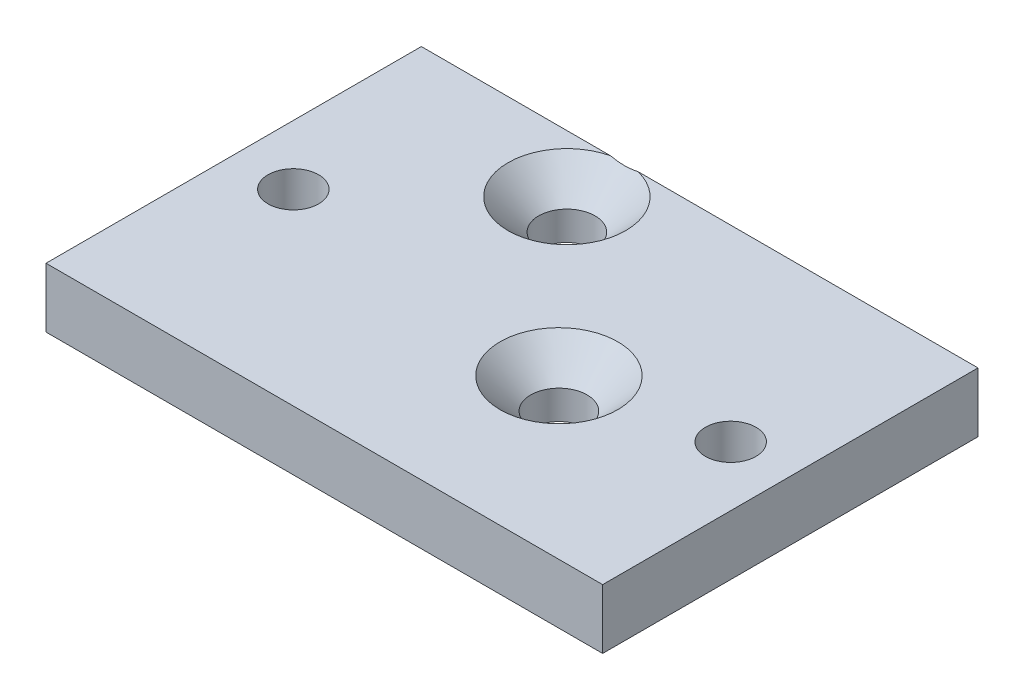
ISO-10303-21;
HEADER;
FILE_DESCRIPTION(('STEP AP214'),'2;1');
FILE_NAME('part.step','',(''),(''),'','','');
FILE_SCHEMA(('AUTOMOTIVE_DESIGN { 1 0 10303 214 1 1 1 1 }'));
ENDSEC;
DATA;
#1=APPLICATION_CONTEXT('core data for automotive mechanical design processes');
#2=APPLICATION_PROTOCOL_DEFINITION('international standard','automotive_design',2000,#1);
#3=PRODUCT_CONTEXT('',#1,'mechanical');
#4=PRODUCT('Part','Part','',(#3));
#5=PRODUCT_RELATED_PRODUCT_CATEGORY('part','',(#4));
#6=PRODUCT_DEFINITION_FORMATION('','',#4);
#7=PRODUCT_DEFINITION_CONTEXT('part definition',#1,'design');
#8=PRODUCT_DEFINITION('design','',#6,#7);
#9=PRODUCT_DEFINITION_SHAPE('','',#8);
#10=(LENGTH_UNIT() NAMED_UNIT(*) SI_UNIT(.MILLI.,.METRE.));
#11=(NAMED_UNIT(*) PLANE_ANGLE_UNIT() SI_UNIT($,.RADIAN.));
#12=(NAMED_UNIT(*) SI_UNIT($,.STERADIAN.) SOLID_ANGLE_UNIT());
#13=UNCERTAINTY_MEASURE_WITH_UNIT(LENGTH_MEASURE(1.E-05),#10,'distance_accuracy_value','');
#14=(GEOMETRIC_REPRESENTATION_CONTEXT(3) GLOBAL_UNCERTAINTY_ASSIGNED_CONTEXT((#13)) GLOBAL_UNIT_ASSIGNED_CONTEXT((#10,
#11,#12)) REPRESENTATION_CONTEXT('',''));
#15=CARTESIAN_POINT('',(0.,0.,0.));
#16=DIRECTION('',(0.,0.,1.));
#17=DIRECTION('',(1.,0.,0.));
#18=AXIS2_PLACEMENT_3D('',#15,#16,#17);
#19=CARTESIAN_POINT('',(0.,0.,-29.972));
#20=DIRECTION('',(0.,-1.,0.));
#21=DIRECTION('',(0.,0.,-1.));
#22=AXIS2_PLACEMENT_3D('',#19,#20,#21);
#23=PLANE('',#22);
#24=CARTESIAN_POINT('',(16.1925,0.,-25.4));
#25=DIRECTION('',(0.,1.,0.));
#26=DIRECTION('',(0.,0.,1.));
#27=AXIS2_PLACEMENT_3D('',#24,#25,#26);
#28=CIRCLE('',#27,2.25);
#29=CARTESIAN_POINT('',(16.1925,0.,-23.15));
#30=VERTEX_POINT('',#29);
#31=EDGE_CURVE('E158',#30,#30,#28,.T.);
#32=ORIENTED_EDGE('',*,*,#31,.T.);
#33=EDGE_LOOP('',(#32));
#34=FACE_BOUND('',#33,.T.);
#35=CARTESIAN_POINT('',(39.6875,0.,-14.986));
#36=DIRECTION('',(0.,1.,0.));
#37=DIRECTION('',(0.,0.,1.));
#38=AXIS2_PLACEMENT_3D('',#35,#36,#37);
#39=CIRCLE('',#38,2.01929999999999);
#40=CARTESIAN_POINT('',(39.6875,0.,-12.9667));
#41=VERTEX_POINT('',#40);
#42=EDGE_CURVE('E126',#41,#41,#39,.T.);
#43=ORIENTED_EDGE('',*,*,#42,.T.);
#44=EDGE_LOOP('',(#43));
#45=FACE_BOUND('',#44,.T.);
#46=DIRECTION('',(0.,0.,1.));
#47=VECTOR('',#46,1.);
#48=CARTESIAN_POINT('',(0.,0.,0.));
#49=LINE('',#48,#47);
#50=CARTESIAN_POINT('',(0.,0.,-29.972));
#51=VERTEX_POINT('',#50);
#52=CARTESIAN_POINT('',(0.,0.,0.));
#53=VERTEX_POINT('',#52);
#54=EDGE_CURVE('E118',#51,#53,#49,.T.);
#55=ORIENTED_EDGE('',*,*,#54,.F.);
#56=DIRECTION('',(-1.,0.,0.));
#57=VECTOR('',#56,1.);
#58=CARTESIAN_POINT('',(0.,0.,-29.972));
#59=LINE('',#58,#57);
#60=CARTESIAN_POINT('',(44.45,0.,-29.972));
#61=VERTEX_POINT('',#60);
#62=EDGE_CURVE('E131',#61,#51,#59,.T.);
#63=ORIENTED_EDGE('',*,*,#62,.F.);
#64=DIRECTION('',(0.,0.,-1.));
#65=VECTOR('',#64,1.);
#66=CARTESIAN_POINT('',(44.45,0.,0.));
#67=LINE('',#66,#65);
#68=CARTESIAN_POINT('',(44.45,0.,0.));
#69=VERTEX_POINT('',#68);
#70=EDGE_CURVE('E123',#69,#61,#67,.T.);
#71=ORIENTED_EDGE('',*,*,#70,.F.);
#72=DIRECTION('',(1.,0.,0.));
#73=VECTOR('',#72,1.);
#74=CARTESIAN_POINT('',(0.,0.,0.));
#75=LINE('',#74,#73);
#76=EDGE_CURVE('E115',#53,#69,#75,.T.);
#77=ORIENTED_EDGE('',*,*,#76,.F.);
#78=EDGE_LOOP('',(#55,#63,#71,#77));
#79=FACE_BOUND('',#78,.T.);
#80=CARTESIAN_POINT('',(4.7625,0.,-14.986));
#81=DIRECTION('',(0.,1.,0.));
#82=DIRECTION('',(0.,0.,1.));
#83=AXIS2_PLACEMENT_3D('',#80,#81,#82);
#84=CIRCLE('',#83,2.01929999999999);
#85=CARTESIAN_POINT('',(4.7625,0.,-12.9667));
#86=VERTEX_POINT('',#85);
#87=EDGE_CURVE('E90',#86,#86,#84,.T.);
#88=ORIENTED_EDGE('',*,*,#87,.T.);
#89=EDGE_LOOP('',(#88));
#90=FACE_BOUND('',#89,.T.);
#91=CARTESIAN_POINT('',(28.2575,0.,-12.7));
#92=DIRECTION('',(0.,1.,0.));
#93=DIRECTION('',(0.,0.,1.));
#94=AXIS2_PLACEMENT_3D('',#91,#92,#93);
#95=CIRCLE('',#94,2.25);
#96=CARTESIAN_POINT('',(28.2575,0.,-10.45));
#97=VERTEX_POINT('',#96);
#98=EDGE_CURVE('E148',#97,#97,#95,.T.);
#99=ORIENTED_EDGE('',*,*,#98,.T.);
#100=EDGE_LOOP('',(#99));
#101=FACE_BOUND('',#100,.T.);
#102=ADVANCED_FACE('F35',(#34,#45,#79,#90,#101),#23,.T.);
#103=CARTESIAN_POINT('',(0.,4.7625,0.));
#104=DIRECTION('',(1.,0.,0.));
#105=DIRECTION('',(0.,0.,-1.));
#106=AXIS2_PLACEMENT_3D('',#103,#104,#105);
#107=PLANE('',#106);
#108=ORIENTED_EDGE('',*,*,#54,.T.);
#109=DIRECTION('',(0.,-1.,0.));
#110=VECTOR('',#109,1.);
#111=CARTESIAN_POINT('',(0.,4.7625,0.));
#112=LINE('',#111,#110);
#113=CARTESIAN_POINT('',(0.,4.7625,0.));
#114=VERTEX_POINT('',#113);
#115=EDGE_CURVE('E48',#114,#53,#112,.T.);
#116=ORIENTED_EDGE('',*,*,#115,.F.);
#117=DIRECTION('',(0.,0.,1.));
#118=VECTOR('',#117,1.);
#119=CARTESIAN_POINT('',(0.,4.7625,0.));
#120=LINE('',#119,#118);
#121=CARTESIAN_POINT('',(0.,4.7625,-29.972));
#122=VERTEX_POINT('',#121);
#123=EDGE_CURVE('E133',#122,#114,#120,.T.);
#124=ORIENTED_EDGE('',*,*,#123,.F.);
#125=DIRECTION('',(0.,-1.,0.));
#126=VECTOR('',#125,1.);
#127=CARTESIAN_POINT('',(0.,4.7625,-29.972));
#128=LINE('',#127,#126);
#129=EDGE_CURVE('E95',#122,#51,#128,.T.);
#130=ORIENTED_EDGE('',*,*,#129,.T.);
#131=EDGE_LOOP('',(#108,#116,#124,#130));
#132=FACE_BOUND('',#131,.T.);
#133=ADVANCED_FACE('F37',(#132),#107,.F.);
#134=CARTESIAN_POINT('',(0.,4.7625,0.));
#135=DIRECTION('',(0.,0.,-1.));
#136=DIRECTION('',(-1.,0.,0.));
#137=AXIS2_PLACEMENT_3D('',#134,#135,#136);
#138=PLANE('',#137);
#139=ORIENTED_EDGE('',*,*,#76,.T.);
#140=DIRECTION('',(0.,-1.,0.));
#141=VECTOR('',#140,1.);
#142=CARTESIAN_POINT('',(44.45,4.7625,0.));
#143=LINE('',#142,#141);
#144=CARTESIAN_POINT('',(44.45,4.7625,0.));
#145=VERTEX_POINT('',#144);
#146=EDGE_CURVE('E107',#145,#69,#143,.T.);
#147=ORIENTED_EDGE('',*,*,#146,.F.);
#148=DIRECTION('',(1.,0.,0.));
#149=VECTOR('',#148,1.);
#150=CARTESIAN_POINT('',(0.,4.7625,0.));
#151=LINE('',#150,#149);
#152=EDGE_CURVE('E99',#114,#145,#151,.T.);
#153=ORIENTED_EDGE('',*,*,#152,.F.);
#154=ORIENTED_EDGE('',*,*,#115,.T.);
#155=EDGE_LOOP('',(#139,#147,#153,#154));
#156=FACE_BOUND('',#155,.T.);
#157=ADVANCED_FACE('F113',(#156),#138,.F.);
#158=CARTESIAN_POINT('',(44.45,4.7625,0.));
#159=DIRECTION('',(-1.,0.,0.));
#160=DIRECTION('',(0.,0.,1.));
#161=AXIS2_PLACEMENT_3D('',#158,#159,#160);
#162=PLANE('',#161);
#163=ORIENTED_EDGE('',*,*,#70,.T.);
#164=DIRECTION('',(0.,-1.,0.));
#165=VECTOR('',#164,1.);
#166=CARTESIAN_POINT('',(44.45,4.7625,-29.972));
#167=LINE('',#166,#165);
#168=CARTESIAN_POINT('',(44.45,4.7625,-29.972));
#169=VERTEX_POINT('',#168);
#170=EDGE_CURVE('E104',#169,#61,#167,.T.);
#171=ORIENTED_EDGE('',*,*,#170,.F.);
#172=DIRECTION('',(0.,0.,-1.));
#173=VECTOR('',#172,1.);
#174=CARTESIAN_POINT('',(44.45,4.7625,0.));
#175=LINE('',#174,#173);
#176=EDGE_CURVE('E97',#145,#169,#175,.T.);
#177=ORIENTED_EDGE('',*,*,#176,.F.);
#178=ORIENTED_EDGE('',*,*,#146,.T.);
#179=EDGE_LOOP('',(#163,#171,#177,#178));
#180=FACE_BOUND('',#179,.T.);
#181=ADVANCED_FACE('F138',(#180),#162,.F.);
#182=CARTESIAN_POINT('',(0.,4.7625,-29.972));
#183=DIRECTION('',(0.,0.,1.));
#184=DIRECTION('',(1.,0.,0.));
#185=AXIS2_PLACEMENT_3D('',#182,#183,#184);
#186=PLANE('',#185);
#187=DIRECTION('',(-1.,0.,0.));
#188=VECTOR('',#187,1.);
#189=CARTESIAN_POINT('',(0.,4.7625,-29.972));
#190=LINE('',#189,#188);
#191=CARTESIAN_POINT('',(15.1030891500449,4.7625,-29.972));
#192=VERTEX_POINT('',#191);
#193=EDGE_CURVE('E60',#192,#122,#190,.T.);
#194=ORIENTED_EDGE('',*,*,#193,.F.);
#195=CARTESIAN_POINT('',(6.24009764916176,11.0148283621781,-29.972));
#196=CARTESIAN_POINT('',(6.45195342883205,10.8223349293208,-29.972));
#197=CARTESIAN_POINT('',(6.66432476272242,10.6304051010854,-29.972));
#198=CARTESIAN_POINT('',(7.09034867112008,10.2479513489384,-29.972));
#199=CARTESIAN_POINT('',(7.30400131061275,10.0574274974473,-29.972));
#200=CARTESIAN_POINT('',(7.7333116237082,9.67764600004868,-29.972));
#201=CARTESIAN_POINT('',(7.94897278889506,9.48839229578767,-29.972));
#202=CARTESIAN_POINT('',(8.38213151876999,9.11200493672459,-29.972));
#203=CARTESIAN_POINT('',(8.59962904483972,8.92487123753207,-29.972));
#204=CARTESIAN_POINT('',(9.05686416110622,8.53626251613531,-29.972));
#205=CARTESIAN_POINT('',(9.29681717417677,8.33504040514064,-29.972));
#206=CARTESIAN_POINT('',(9.78011213959654,7.93670791722538,-29.972));
#207=CARTESIAN_POINT('',(10.0234539947177,7.73959742274349,-29.972));
#208=CARTESIAN_POINT('',(10.5142412619671,7.35107548865928,-29.972));
#209=CARTESIAN_POINT('',(10.7616820755168,7.15965825768191,-29.972));
#210=CARTESIAN_POINT('',(11.2622107361905,6.78436045441689,-29.972));
#211=CARTESIAN_POINT('',(11.5152977017044,6.60047871805602,-29.972));
#212=CARTESIAN_POINT('',(11.9038931316203,6.33038890935885,-29.972));
#213=CARTESIAN_POINT('',(12.0366470077691,6.24021908559975,-29.972));
#214=CARTESIAN_POINT('',(12.3044361324151,6.06334135684351,-29.972));
#215=CARTESIAN_POINT('',(12.4394712098689,5.97663319391794,-29.972));
#216=CARTESIAN_POINT('',(12.712380272297,5.80731930880105,-29.972));
#217=CARTESIAN_POINT('',(12.8502582062947,5.72471992549132,-29.972));
#218=CARTESIAN_POINT('',(13.1290364715524,5.56476827028971,-29.972));
#219=CARTESIAN_POINT('',(13.269936706849,5.48741583212182,-29.972));
#220=CARTESIAN_POINT('',(13.5518505596636,5.34095111119898,-29.972));
#221=CARTESIAN_POINT('',(13.6927861206215,5.27168957982904,-29.972));
#222=CARTESIAN_POINT('',(13.978255259558,5.14088262493837,-29.972));
#223=CARTESIAN_POINT('',(14.1227894342639,5.07933849147924,-29.972));
#224=CARTESIAN_POINT('',(14.4151760172279,4.96596445900419,-29.972));
#225=CARTESIAN_POINT('',(14.5630176184399,4.91410697692276,-29.972));
#226=CARTESIAN_POINT('',(14.8622232934016,4.82197567818963,-29.972));
#227=CARTESIAN_POINT('',(15.0135848952628,4.78169398313297,-29.972));
#228=CARTESIAN_POINT('',(15.2797964825983,4.72339796543963,-29.972));
#229=CARTESIAN_POINT('',(15.3939763706465,4.70231944774768,-29.972));
#230=CARTESIAN_POINT('',(15.6235734262336,4.66836365621391,-29.972));
#231=CARTESIAN_POINT('',(15.7389906642036,4.6554868517686,-29.972));
#232=CARTESIAN_POINT('',(15.9703250446608,4.63844357829596,-29.972));
#233=CARTESIAN_POINT('',(16.0862413601427,4.6342660026603,-29.972));
#234=CARTESIAN_POINT('',(16.318055614227,4.63475435892129,-29.972));
#235=CARTESIAN_POINT('',(16.433953552245,4.63942053092871,-29.972));
#236=CARTESIAN_POINT('',(16.6814648984674,4.65869140827196,-29.972));
#237=CARTESIAN_POINT('',(16.8129764704024,4.67461152471454,-29.972));
#238=CARTESIAN_POINT('',(17.0743013062877,4.71697223128381,-29.972));
#239=CARTESIAN_POINT('',(17.2041141064566,4.7434156349352,-29.972));
#240=CARTESIAN_POINT('',(17.4627124349668,4.80599239240662,-29.972));
#241=CARTESIAN_POINT('',(17.5914752355859,4.84221866328578,-29.972));
#242=CARTESIAN_POINT('',(17.8463244827122,4.922922523779,-29.972));
#243=CARTESIAN_POINT('',(17.9724115282192,4.96739824446934,-29.972));
#244=CARTESIAN_POINT('',(18.2709967918466,5.08221674539831,-29.972));
#245=CARTESIAN_POINT('',(18.4422256139544,5.15585000652405,-29.972));
#246=CARTESIAN_POINT('',(18.77977922121,5.3136824504598,-29.972));
#247=CARTESIAN_POINT('',(18.9461011811687,5.39788757899135,-29.972));
#248=CARTESIAN_POINT('',(19.2749314861696,5.57478558471101,-29.972));
#249=CARTESIAN_POINT('',(19.4374233513214,5.66750885800584,-29.972));
#250=CARTESIAN_POINT('',(19.7585313292335,5.85932606697617,-29.972));
#251=CARTESIAN_POINT('',(19.917148204562,5.95841873503703,-29.972));
#252=CARTESIAN_POINT('',(20.2236373018814,6.15678190613575,-29.972));
#253=CARTESIAN_POINT('',(20.3716613828344,6.25581898594016,-29.972));
#254=CARTESIAN_POINT('',(20.6651965702206,6.45756383463478,-29.972));
#255=CARTESIAN_POINT('',(20.8107074692336,6.56027190437554,-29.972));
#256=CARTESIAN_POINT('',(21.0982882989947,6.76772892746014,-29.972));
#257=CARTESIAN_POINT('',(21.2403773548236,6.87245146072977,-29.972));
#258=CARTESIAN_POINT('',(21.522699007952,7.08429481056542,-29.972));
#259=CARTESIAN_POINT('',(21.6629320907778,7.19141497935009,-29.972));
#260=CARTESIAN_POINT('',(21.8024031467771,7.29950195635042,-29.972));
#261=B_SPLINE_CURVE_WITH_KNOTS('',3,(#195,#196,#197,#198,#199,#200,#201,#202,#203,#204,#205,
#206,#207,#208,#209,#210,#211,#212,#213,#214,#215,#216,#217,#218,#219,#220,#221,#222,#223,#224,
#225,#226,#227,#228,#229,#230,#231,#232,#233,#234,#235,#236,#237,#238,#239,#240,#241,#242,#243,
#244,#245,#246,#247,#248,#249,#250,#251,#252,#253,#254,#255,#256,#257,#258,#259,#260),
.UNSPECIFIED.,.F.,.F.,(4,2,2,2,2,2,2,2,2,2,2,2,2,2,2,2,2,2,2,2,2,2,2,2,2,2,2,2,2,2,2,2,4),(0.,
0.858739853234425,1.71752363479409,2.57829122978584,3.43904076786091,4.37848017101969,
5.31789267635762,6.25631441070415,7.19459062819409,7.67599230188746,8.15735803913182,
8.63944473555942,9.1215161474862,9.59243340709465,10.0634292818921,10.5330628235263,
11.0023759745214,11.3504388606916,11.6985216652403,12.0461597871928,12.3938073477743,
12.7907493519877,13.1877975546955,13.5887582695035,13.98962825684,14.5483057569827,
15.1072988822723,15.6683705337668,16.2293308664218,16.763563930981,17.2978408786638,
17.8273461074526,18.3567099639255),.UNSPECIFIED.);
#262=CARTESIAN_POINT('',(17.2819108499551,4.7625,-29.972));
#263=VERTEX_POINT('',#262);
#264=EDGE_CURVE('E11',#192,#263,#261,.T.);
#265=ORIENTED_EDGE('',*,*,#264,.T.);
#266=EDGE_CURVE('E89',#169,#263,#190,.T.);
#267=ORIENTED_EDGE('',*,*,#266,.F.);
#268=ORIENTED_EDGE('',*,*,#170,.T.);
#269=ORIENTED_EDGE('',*,*,#62,.T.);
#270=ORIENTED_EDGE('',*,*,#129,.F.);
#271=EDGE_LOOP('',(#194,#265,#267,#268,#269,#270));
#272=FACE_BOUND('',#271,.T.);
#273=ADVANCED_FACE('F93',(#272),#186,.F.);
#274=CARTESIAN_POINT('',(0.,4.7625,-29.972));
#275=DIRECTION('',(0.,-1.,0.));
#276=DIRECTION('',(0.,0.,-1.));
#277=AXIS2_PLACEMENT_3D('',#274,#275,#276);
#278=PLANE('',#277);
#279=CARTESIAN_POINT('',(28.2575,4.7625,-12.7));
#280=DIRECTION('',(0.,1.,0.));
#281=DIRECTION('',(0.,0.,1.));
#282=AXIS2_PLACEMENT_3D('',#279,#280,#281);
#283=CIRCLE('',#282,4.7);
#284=CARTESIAN_POINT('',(28.2575,4.7625,-8.));
#285=VERTEX_POINT('',#284);
#286=EDGE_CURVE('E153',#285,#285,#283,.T.);
#287=ORIENTED_EDGE('',*,*,#286,.F.);
#288=EDGE_LOOP('',(#287));
#289=FACE_BOUND('',#288,.T.);
#290=CARTESIAN_POINT('',(4.7625,4.7625,-14.986));
#291=DIRECTION('',(0.,1.,0.));
#292=DIRECTION('',(0.,0.,1.));
#293=AXIS2_PLACEMENT_3D('',#290,#291,#292);
#294=CIRCLE('',#293,2.01929999999999);
#295=CARTESIAN_POINT('',(4.7625,4.7625,-12.9667));
#296=VERTEX_POINT('',#295);
#297=EDGE_CURVE('E164',#296,#296,#294,.T.);
#298=ORIENTED_EDGE('',*,*,#297,.F.);
#299=EDGE_LOOP('',(#298));
#300=FACE_BOUND('',#299,.T.);
#301=CARTESIAN_POINT('',(39.6875,4.7625,-14.986));
#302=DIRECTION('',(0.,1.,0.));
#303=DIRECTION('',(0.,0.,1.));
#304=AXIS2_PLACEMENT_3D('',#301,#302,#303);
#305=CIRCLE('',#304,2.01929999999999);
#306=CARTESIAN_POINT('',(39.6875,4.7625,-12.9667));
#307=VERTEX_POINT('',#306);
#308=EDGE_CURVE('E121',#307,#307,#305,.T.);
#309=ORIENTED_EDGE('',*,*,#308,.F.);
#310=EDGE_LOOP('',(#309));
#311=FACE_BOUND('',#310,.T.);
#312=ORIENTED_EDGE('',*,*,#266,.T.);
#313=CARTESIAN_POINT('',(16.1925,4.7625,-25.4));
#314=DIRECTION('',(0.,1.,0.));
#315=DIRECTION('',(0.,0.,1.));
#316=AXIS2_PLACEMENT_3D('',#313,#314,#315);
#317=CIRCLE('',#316,4.7);
#318=EDGE_CURVE('E54',#192,#263,#317,.T.);
#319=ORIENTED_EDGE('',*,*,#318,.F.);
#320=ORIENTED_EDGE('',*,*,#193,.T.);
#321=ORIENTED_EDGE('',*,*,#123,.T.);
#322=ORIENTED_EDGE('',*,*,#152,.T.);
#323=ORIENTED_EDGE('',*,*,#176,.T.);
#324=EDGE_LOOP('',(#312,#319,#320,#321,#322,#323));
#325=FACE_BOUND('',#324,.T.);
#326=ADVANCED_FACE('F88',(#289,#300,#311,#325),#278,.F.);
#327=CARTESIAN_POINT('',(39.6875,4.7625,-14.986));
#328=DIRECTION('',(0.,1.,0.));
#329=DIRECTION('',(0.,0.,1.));
#330=AXIS2_PLACEMENT_3D('',#327,#328,#329);
#331=CYLINDRICAL_SURFACE('',#330,2.01929999999999);
#332=ORIENTED_EDGE('',*,*,#42,.F.);
#333=EDGE_LOOP('',(#332));
#334=FACE_BOUND('',#333,.T.);
#335=ORIENTED_EDGE('',*,*,#308,.T.);
#336=EDGE_LOOP('',(#335));
#337=FACE_BOUND('',#336,.T.);
#338=ADVANCED_FACE('F170',(#334,#337),#331,.F.);
#339=CARTESIAN_POINT('',(4.7625,4.7625,-14.986));
#340=DIRECTION('',(0.,1.,0.));
#341=DIRECTION('',(0.,0.,1.));
#342=AXIS2_PLACEMENT_3D('',#339,#340,#341);
#343=CYLINDRICAL_SURFACE('',#342,2.01929999999999);
#344=ORIENTED_EDGE('',*,*,#87,.F.);
#345=EDGE_LOOP('',(#344));
#346=FACE_BOUND('',#345,.T.);
#347=ORIENTED_EDGE('',*,*,#297,.T.);
#348=EDGE_LOOP('',(#347));
#349=FACE_BOUND('',#348,.T.);
#350=ADVANCED_FACE('F173',(#346,#349),#343,.F.);
#351=CARTESIAN_POINT('',(16.1925,4.7625,-25.4));
#352=DIRECTION('',(0.,1.,0.));
#353=DIRECTION('',(0.,0.,1.));
#354=AXIS2_PLACEMENT_3D('',#351,#352,#353);
#355=CONICAL_SURFACE('',#354,4.7,0.785398163397449);
#356=CARTESIAN_POINT('',(16.1925,2.3125,-25.4));
#357=DIRECTION('',(0.,1.,0.));
#358=DIRECTION('',(0.,0.,1.));
#359=AXIS2_PLACEMENT_3D('',#356,#357,#358);
#360=CIRCLE('',#359,2.25);
#361=CARTESIAN_POINT('',(16.1925,2.3125,-23.15));
#362=VERTEX_POINT('',#361);
#363=EDGE_CURVE('E91',#362,#362,#360,.T.);
#364=ORIENTED_EDGE('',*,*,#363,.F.);
#365=EDGE_LOOP('',(#364));
#366=FACE_BOUND('',#365,.T.);
#367=ORIENTED_EDGE('',*,*,#318,.T.);
#368=ORIENTED_EDGE('',*,*,#264,.F.);
#369=EDGE_LOOP('',(#367,#368));
#370=FACE_BOUND('',#369,.T.);
#371=ADVANCED_FACE('F84',(#366,#370),#355,.F.);
#372=CARTESIAN_POINT('',(16.1925,4.7625,-25.4));
#373=DIRECTION('',(0.,1.,0.));
#374=DIRECTION('',(0.,0.,1.));
#375=AXIS2_PLACEMENT_3D('',#372,#373,#374);
#376=CYLINDRICAL_SURFACE('',#375,2.25);
#377=ORIENTED_EDGE('',*,*,#31,.F.);
#378=EDGE_LOOP('',(#377));
#379=FACE_BOUND('',#378,.T.);
#380=ORIENTED_EDGE('',*,*,#363,.T.);
#381=EDGE_LOOP('',(#380));
#382=FACE_BOUND('',#381,.T.);
#383=ADVANCED_FACE('F224',(#379,#382),#376,.F.);
#384=CARTESIAN_POINT('',(28.2575,4.7625,-12.7));
#385=DIRECTION('',(0.,1.,0.));
#386=DIRECTION('',(0.,0.,1.));
#387=AXIS2_PLACEMENT_3D('',#384,#385,#386);
#388=CONICAL_SURFACE('',#387,4.7,0.785398163397449);
#389=CARTESIAN_POINT('',(28.2575,2.3125,-12.7));
#390=DIRECTION('',(0.,1.,0.));
#391=DIRECTION('',(0.,0.,1.));
#392=AXIS2_PLACEMENT_3D('',#389,#390,#391);
#393=CIRCLE('',#392,2.25);
#394=CARTESIAN_POINT('',(28.2575,2.3125,-10.45));
#395=VERTEX_POINT('',#394);
#396=EDGE_CURVE('E150',#395,#395,#393,.T.);
#397=ORIENTED_EDGE('',*,*,#396,.F.);
#398=EDGE_LOOP('',(#397));
#399=FACE_BOUND('',#398,.T.);
#400=ORIENTED_EDGE('',*,*,#286,.T.);
#401=EDGE_LOOP('',(#400));
#402=FACE_BOUND('',#401,.T.);
#403=ADVANCED_FACE('F234',(#399,#402),#388,.F.);
#404=CARTESIAN_POINT('',(28.2575,4.7625,-12.7));
#405=DIRECTION('',(0.,1.,0.));
#406=DIRECTION('',(0.,0.,1.));
#407=AXIS2_PLACEMENT_3D('',#404,#405,#406);
#408=CYLINDRICAL_SURFACE('',#407,2.25);
#409=ORIENTED_EDGE('',*,*,#98,.F.);
#410=EDGE_LOOP('',(#409));
#411=FACE_BOUND('',#410,.T.);
#412=ORIENTED_EDGE('',*,*,#396,.T.);
#413=EDGE_LOOP('',(#412));
#414=FACE_BOUND('',#413,.T.);
#415=ADVANCED_FACE('F244',(#411,#414),#408,.F.);
#416=CLOSED_SHELL('',(#102,#133,#157,#181,#273,#326,#338,#350,#371,#383,#403,#415));
#417=MANIFOLD_SOLID_BREP('B2',#416);
#418=ADVANCED_BREP_SHAPE_REPRESENTATION('',(#18,#417),#14);
#419=SHAPE_DEFINITION_REPRESENTATION(#9,#418);
ENDSEC;
END-ISO-10303-21;
